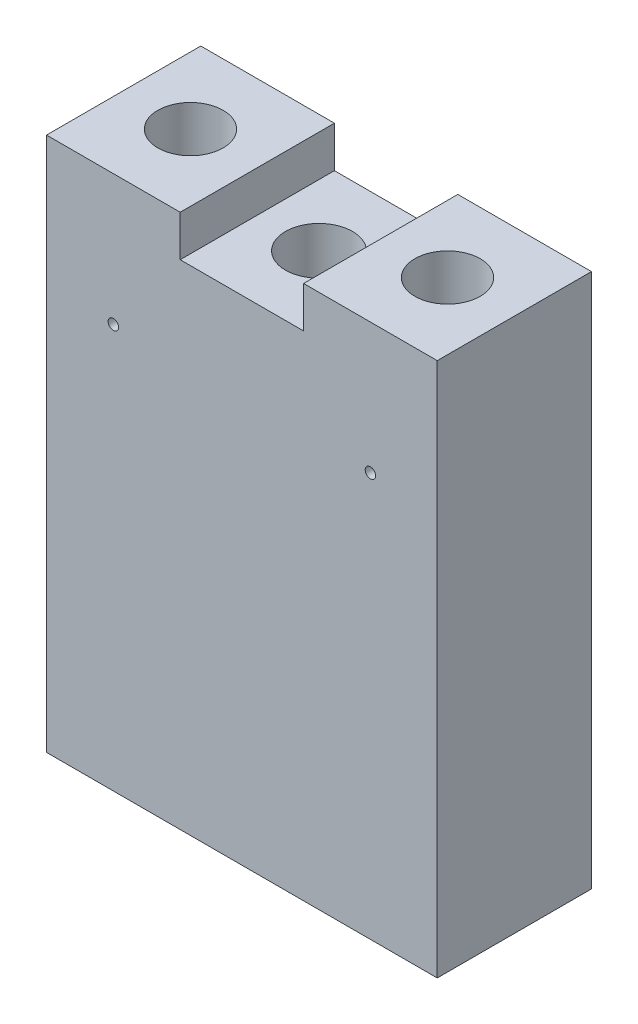
ISO-10303-21;
HEADER;
FILE_DESCRIPTION(('STEP AP214'),'2;1');
FILE_NAME('part.step','',(''),(''),'','','');
FILE_SCHEMA(('AUTOMOTIVE_DESIGN { 1 0 10303 214 1 1 1 1 }'));
ENDSEC;
DATA;
#1=APPLICATION_CONTEXT('core data for automotive mechanical design processes');
#2=APPLICATION_PROTOCOL_DEFINITION('international standard','automotive_design',2000,#1);
#3=PRODUCT_CONTEXT('',#1,'mechanical');
#4=PRODUCT('Part','Part','',(#3));
#5=PRODUCT_RELATED_PRODUCT_CATEGORY('part','',(#4));
#6=PRODUCT_DEFINITION_FORMATION('','',#4);
#7=PRODUCT_DEFINITION_CONTEXT('part definition',#1,'design');
#8=PRODUCT_DEFINITION('design','',#6,#7);
#9=PRODUCT_DEFINITION_SHAPE('','',#8);
#10=(LENGTH_UNIT() NAMED_UNIT(*) SI_UNIT(.MILLI.,.METRE.));
#11=(NAMED_UNIT(*) PLANE_ANGLE_UNIT() SI_UNIT($,.RADIAN.));
#12=(NAMED_UNIT(*) SI_UNIT($,.STERADIAN.) SOLID_ANGLE_UNIT());
#13=UNCERTAINTY_MEASURE_WITH_UNIT(LENGTH_MEASURE(1.E-05),#10,'distance_accuracy_value','');
#14=(GEOMETRIC_REPRESENTATION_CONTEXT(3) GLOBAL_UNCERTAINTY_ASSIGNED_CONTEXT((#13)) GLOBAL_UNIT_ASSIGNED_CONTEXT((#10,
#11,#12)) REPRESENTATION_CONTEXT('',''));
#15=CARTESIAN_POINT('',(0.,0.,0.));
#16=DIRECTION('',(0.,0.,1.));
#17=DIRECTION('',(1.,0.,0.));
#18=AXIS2_PLACEMENT_3D('',#15,#16,#17);
#19=CARTESIAN_POINT('',(-19.,52.0000000000001,15.));
#20=DIRECTION('',(0.,-1.,0.));
#21=DIRECTION('',(0.,0.,-1.));
#22=AXIS2_PLACEMENT_3D('',#19,#20,#21);
#23=PLANE('',#22);
#24=CARTESIAN_POINT('',(-12.5,52.0000000000001,7.5));
#25=DIRECTION('',(0.,1.,0.));
#26=DIRECTION('',(0.,0.,1.));
#27=AXIS2_PLACEMENT_3D('',#24,#25,#26);
#28=CIRCLE('',#27,3.175);
#29=CARTESIAN_POINT('',(-12.5,52.0000000000001,10.675));
#30=VERTEX_POINT('',#29);
#31=EDGE_CURVE('E163',#30,#30,#28,.T.);
#32=ORIENTED_EDGE('',*,*,#31,.F.);
#33=EDGE_LOOP('',(#32));
#34=FACE_BOUND('',#33,.T.);
#35=DIRECTION('',(-1.,0.,0.));
#36=VECTOR('',#35,1.);
#37=CARTESIAN_POINT('',(-19.,52.0000000000001,15.));
#38=LINE('',#37,#36);
#39=CARTESIAN_POINT('',(-6.00000000000002,52.0000000000001,15.));
#40=VERTEX_POINT('',#39);
#41=CARTESIAN_POINT('',(-19.,52.0000000000001,15.));
#42=VERTEX_POINT('',#41);
#43=EDGE_CURVE('E56',#40,#42,#38,.T.);
#44=ORIENTED_EDGE('',*,*,#43,.F.);
#45=DIRECTION('',(0.,0.,1.));
#46=VECTOR('',#45,1.);
#47=CARTESIAN_POINT('',(-6.00000000000002,52.0000000000001,0.));
#48=LINE('',#47,#46);
#49=CARTESIAN_POINT('',(-6.00000000000002,52.0000000000001,0.));
#50=VERTEX_POINT('',#49);
#51=EDGE_CURVE('E100',#50,#40,#48,.T.);
#52=ORIENTED_EDGE('',*,*,#51,.F.);
#53=DIRECTION('',(-1.,0.,0.));
#54=VECTOR('',#53,1.);
#55=CARTESIAN_POINT('',(-19.,52.0000000000001,0.));
#56=LINE('',#55,#54);
#57=CARTESIAN_POINT('',(-19.,52.0000000000001,0.));
#58=VERTEX_POINT('',#57);
#59=EDGE_CURVE('E149',#50,#58,#56,.T.);
#60=ORIENTED_EDGE('',*,*,#59,.T.);
#61=DIRECTION('',(0.,0.,-1.));
#62=VECTOR('',#61,1.);
#63=CARTESIAN_POINT('',(-19.,52.0000000000001,15.));
#64=LINE('',#63,#62);
#65=EDGE_CURVE('E119',#42,#58,#64,.T.);
#66=ORIENTED_EDGE('',*,*,#65,.F.);
#67=EDGE_LOOP('',(#44,#52,#60,#66));
#68=FACE_BOUND('',#67,.T.);
#69=ADVANCED_FACE('F33',(#34,#68),#23,.F.);
#70=CARTESIAN_POINT('',(-19.,52.0000000000001,15.));
#71=DIRECTION('',(1.,0.,0.));
#72=DIRECTION('',(0.,1.,0.));
#73=AXIS2_PLACEMENT_3D('',#70,#71,#72);
#74=PLANE('',#73);
#75=DIRECTION('',(0.,-1.,0.));
#76=VECTOR('',#75,1.);
#77=CARTESIAN_POINT('',(-19.,52.0000000000001,0.));
#78=LINE('',#77,#76);
#79=CARTESIAN_POINT('',(-19.,0.,0.));
#80=VERTEX_POINT('',#79);
#81=EDGE_CURVE('E152',#58,#80,#78,.T.);
#82=ORIENTED_EDGE('',*,*,#81,.T.);
#83=DIRECTION('',(0.,0.,-1.));
#84=VECTOR('',#83,1.);
#85=CARTESIAN_POINT('',(-19.,0.,15.));
#86=LINE('',#85,#84);
#87=CARTESIAN_POINT('',(-19.,0.,15.));
#88=VERTEX_POINT('',#87);
#89=EDGE_CURVE('E11',#88,#80,#86,.T.);
#90=ORIENTED_EDGE('',*,*,#89,.F.);
#91=DIRECTION('',(0.,-1.,0.));
#92=VECTOR('',#91,1.);
#93=CARTESIAN_POINT('',(-19.,52.0000000000001,15.));
#94=LINE('',#93,#92);
#95=EDGE_CURVE('E156',#42,#88,#94,.T.);
#96=ORIENTED_EDGE('',*,*,#95,.F.);
#97=ORIENTED_EDGE('',*,*,#65,.T.);
#98=EDGE_LOOP('',(#82,#90,#96,#97));
#99=FACE_BOUND('',#98,.T.);
#100=ADVANCED_FACE('F35',(#99),#74,.F.);
#101=CARTESIAN_POINT('',(-19.,0.,15.));
#102=DIRECTION('',(0.,1.,0.));
#103=DIRECTION('',(0.,0.,1.));
#104=AXIS2_PLACEMENT_3D('',#101,#102,#103);
#105=PLANE('',#104);
#106=CARTESIAN_POINT('',(0.,0.,7.5));
#107=DIRECTION('',(0.,1.,0.));
#108=DIRECTION('',(0.,0.,1.));
#109=AXIS2_PLACEMENT_3D('',#106,#107,#108);
#110=CIRCLE('',#109,3.26389999999999);
#111=CARTESIAN_POINT('',(0.,0.,10.7639));
#112=VERTEX_POINT('',#111);
#113=EDGE_CURVE('E186',#112,#112,#110,.T.);
#114=ORIENTED_EDGE('',*,*,#113,.T.);
#115=EDGE_LOOP('',(#114));
#116=FACE_BOUND('',#115,.T.);
#117=DIRECTION('',(1.,0.,0.));
#118=VECTOR('',#117,1.);
#119=CARTESIAN_POINT('',(-19.,0.,0.));
#120=LINE('',#119,#118);
#121=CARTESIAN_POINT('',(19.,0.,0.));
#122=VERTEX_POINT('',#121);
#123=EDGE_CURVE('E145',#80,#122,#120,.T.);
#124=ORIENTED_EDGE('',*,*,#123,.T.);
#125=DIRECTION('',(0.,0.,-1.));
#126=VECTOR('',#125,1.);
#127=CARTESIAN_POINT('',(19.,0.,15.));
#128=LINE('',#127,#126);
#129=CARTESIAN_POINT('',(19.,0.,15.));
#130=VERTEX_POINT('',#129);
#131=EDGE_CURVE('E41',#130,#122,#128,.T.);
#132=ORIENTED_EDGE('',*,*,#131,.F.);
#133=DIRECTION('',(1.,0.,0.));
#134=VECTOR('',#133,1.);
#135=CARTESIAN_POINT('',(-19.,0.,15.));
#136=LINE('',#135,#134);
#137=EDGE_CURVE('E125',#88,#130,#136,.T.);
#138=ORIENTED_EDGE('',*,*,#137,.F.);
#139=ORIENTED_EDGE('',*,*,#89,.T.);
#140=EDGE_LOOP('',(#124,#132,#138,#139));
#141=FACE_BOUND('',#140,.T.);
#142=ADVANCED_FACE('F158',(#116,#141),#105,.F.);
#143=CARTESIAN_POINT('',(19.,52.0000000000001,15.));
#144=DIRECTION('',(-1.,0.,0.));
#145=DIRECTION('',(0.,-1.,0.));
#146=AXIS2_PLACEMENT_3D('',#143,#144,#145);
#147=PLANE('',#146);
#148=DIRECTION('',(0.,1.,0.));
#149=VECTOR('',#148,1.);
#150=CARTESIAN_POINT('',(19.,52.0000000000001,0.));
#151=LINE('',#150,#149);
#152=CARTESIAN_POINT('',(19.,52.0000000000001,0.));
#153=VERTEX_POINT('',#152);
#154=EDGE_CURVE('E139',#122,#153,#151,.T.);
#155=ORIENTED_EDGE('',*,*,#154,.T.);
#156=DIRECTION('',(0.,0.,-1.));
#157=VECTOR('',#156,1.);
#158=CARTESIAN_POINT('',(19.,52.0000000000001,15.));
#159=LINE('',#158,#157);
#160=CARTESIAN_POINT('',(19.,52.0000000000001,15.));
#161=VERTEX_POINT('',#160);
#162=EDGE_CURVE('E130',#161,#153,#159,.T.);
#163=ORIENTED_EDGE('',*,*,#162,.F.);
#164=DIRECTION('',(0.,1.,0.));
#165=VECTOR('',#164,1.);
#166=CARTESIAN_POINT('',(19.,52.0000000000001,15.));
#167=LINE('',#166,#165);
#168=EDGE_CURVE('E122',#130,#161,#167,.T.);
#169=ORIENTED_EDGE('',*,*,#168,.F.);
#170=ORIENTED_EDGE('',*,*,#131,.T.);
#171=EDGE_LOOP('',(#155,#163,#169,#170));
#172=FACE_BOUND('',#171,.T.);
#173=ADVANCED_FACE('F137',(#172),#147,.F.);
#174=CARTESIAN_POINT('',(12.5,52.0000000000001,7.5));
#175=DIRECTION('',(0.,1.,0.));
#176=DIRECTION('',(0.,0.,-1.));
#177=AXIS2_PLACEMENT_3D('',#174,#175,#176);
#178=CIRCLE('',#177,3.175);
#179=CARTESIAN_POINT('',(12.5,52.0000000000001,4.325));
#180=VERTEX_POINT('',#179);
#181=EDGE_CURVE('E171',#180,#180,#178,.T.);
#182=ORIENTED_EDGE('',*,*,#181,.F.);
#183=EDGE_LOOP('',(#182));
#184=FACE_BOUND('',#183,.T.);
#185=CARTESIAN_POINT('',(5.99999999999998,52.0000000000001,0.));
#186=VERTEX_POINT('',#185);
#187=EDGE_CURVE('E148',#153,#186,#56,.T.);
#188=ORIENTED_EDGE('',*,*,#187,.T.);
#189=DIRECTION('',(0.,0.,-1.));
#190=VECTOR('',#189,1.);
#191=CARTESIAN_POINT('',(5.99999999999998,52.0000000000001,0.));
#192=LINE('',#191,#190);
#193=CARTESIAN_POINT('',(5.99999999999998,52.0000000000001,15.));
#194=VERTEX_POINT('',#193);
#195=EDGE_CURVE('E108',#194,#186,#192,.T.);
#196=ORIENTED_EDGE('',*,*,#195,.F.);
#197=EDGE_CURVE('E121',#161,#194,#38,.T.);
#198=ORIENTED_EDGE('',*,*,#197,.F.);
#199=ORIENTED_EDGE('',*,*,#162,.T.);
#200=EDGE_LOOP('',(#188,#196,#198,#199));
#201=FACE_BOUND('',#200,.T.);
#202=ADVANCED_FACE('F223',(#184,#201),#23,.F.);
#203=CARTESIAN_POINT('',(-19.,0.,15.));
#204=DIRECTION('',(0.,0.,1.));
#205=DIRECTION('',(1.,0.,0.));
#206=AXIS2_PLACEMENT_3D('',#203,#204,#205);
#207=PLANE('',#206);
#208=CARTESIAN_POINT('',(12.5,39.3,15.));
#209=DIRECTION('',(0.,0.,1.));
#210=DIRECTION('',(1.,0.,0.));
#211=AXIS2_PLACEMENT_3D('',#208,#209,#210);
#212=CIRCLE('',#211,0.507999999999999);
#213=CARTESIAN_POINT('',(13.008,39.3,15.));
#214=VERTEX_POINT('',#213);
#215=EDGE_CURVE('E199',#214,#214,#212,.T.);
#216=ORIENTED_EDGE('',*,*,#215,.F.);
#217=EDGE_LOOP('',(#216));
#218=FACE_BOUND('',#217,.T.);
#219=CARTESIAN_POINT('',(-12.5,39.3,15.));
#220=DIRECTION('',(0.,0.,1.));
#221=DIRECTION('',(1.,0.,0.));
#222=AXIS2_PLACEMENT_3D('',#219,#220,#221);
#223=CIRCLE('',#222,0.507999999999999);
#224=CARTESIAN_POINT('',(-11.992,39.3,15.));
#225=VERTEX_POINT('',#224);
#226=EDGE_CURVE('E189',#225,#225,#223,.T.);
#227=ORIENTED_EDGE('',*,*,#226,.F.);
#228=EDGE_LOOP('',(#227));
#229=FACE_BOUND('',#228,.T.);
#230=DIRECTION('',(0.,1.,0.));
#231=VECTOR('',#230,1.);
#232=CARTESIAN_POINT('',(-6.00000000000002,48.0000000000001,15.));
#233=LINE('',#232,#231);
#234=CARTESIAN_POINT('',(-6.00000000000002,48.0000000000001,15.));
#235=VERTEX_POINT('',#234);
#236=EDGE_CURVE('E102',#235,#40,#233,.T.);
#237=ORIENTED_EDGE('',*,*,#236,.T.);
#238=ORIENTED_EDGE('',*,*,#43,.T.);
#239=ORIENTED_EDGE('',*,*,#95,.T.);
#240=ORIENTED_EDGE('',*,*,#137,.T.);
#241=ORIENTED_EDGE('',*,*,#168,.T.);
#242=ORIENTED_EDGE('',*,*,#197,.T.);
#243=DIRECTION('',(0.,1.,0.));
#244=VECTOR('',#243,1.);
#245=CARTESIAN_POINT('',(5.99999999999998,48.0000000000001,15.));
#246=LINE('',#245,#244);
#247=CARTESIAN_POINT('',(5.99999999999998,48.0000000000001,15.));
#248=VERTEX_POINT('',#247);
#249=EDGE_CURVE('E115',#248,#194,#246,.T.);
#250=ORIENTED_EDGE('',*,*,#249,.F.);
#251=DIRECTION('',(1.,0.,0.));
#252=VECTOR('',#251,1.);
#253=CARTESIAN_POINT('',(-6.00000000000002,48.0000000000001,15.));
#254=LINE('',#253,#252);
#255=EDGE_CURVE('E114',#235,#248,#254,.T.);
#256=ORIENTED_EDGE('',*,*,#255,.F.);
#257=EDGE_LOOP('',(#237,#238,#239,#240,#241,#242,#250,#256));
#258=FACE_BOUND('',#257,.T.);
#259=ADVANCED_FACE('F112',(#218,#229,#258),#207,.T.);
#260=CARTESIAN_POINT('',(-19.,0.,0.));
#261=DIRECTION('',(0.,0.,1.));
#262=DIRECTION('',(1.,0.,0.));
#263=AXIS2_PLACEMENT_3D('',#260,#261,#262);
#264=PLANE('',#263);
#265=ORIENTED_EDGE('',*,*,#59,.F.);
#266=DIRECTION('',(0.,1.,0.));
#267=VECTOR('',#266,1.);
#268=CARTESIAN_POINT('',(-6.00000000000002,48.0000000000001,0.));
#269=LINE('',#268,#267);
#270=CARTESIAN_POINT('',(-6.00000000000002,48.0000000000001,0.));
#271=VERTEX_POINT('',#270);
#272=EDGE_CURVE('E105',#271,#50,#269,.T.);
#273=ORIENTED_EDGE('',*,*,#272,.F.);
#274=DIRECTION('',(-1.,0.,0.));
#275=VECTOR('',#274,1.);
#276=CARTESIAN_POINT('',(-6.00000000000002,48.0000000000001,0.));
#277=LINE('',#276,#275);
#278=CARTESIAN_POINT('',(5.99999999999998,48.0000000000001,0.));
#279=VERTEX_POINT('',#278);
#280=EDGE_CURVE('E116',#279,#271,#277,.T.);
#281=ORIENTED_EDGE('',*,*,#280,.F.);
#282=DIRECTION('',(0.,1.,0.));
#283=VECTOR('',#282,1.);
#284=CARTESIAN_POINT('',(5.99999999999998,48.0000000000001,0.));
#285=LINE('',#284,#283);
#286=EDGE_CURVE('E175',#279,#186,#285,.T.);
#287=ORIENTED_EDGE('',*,*,#286,.T.);
#288=ORIENTED_EDGE('',*,*,#187,.F.);
#289=ORIENTED_EDGE('',*,*,#154,.F.);
#290=ORIENTED_EDGE('',*,*,#123,.F.);
#291=ORIENTED_EDGE('',*,*,#81,.F.);
#292=EDGE_LOOP('',(#265,#273,#281,#287,#288,#289,#290,#291));
#293=FACE_BOUND('',#292,.T.);
#294=ADVANCED_FACE('F143',(#293),#264,.F.);
#295=CARTESIAN_POINT('',(-12.5,34.,7.5));
#296=DIRECTION('',(0.,1.,0.));
#297=DIRECTION('',(0.,0.,1.));
#298=AXIS2_PLACEMENT_3D('',#295,#296,#297);
#299=CYLINDRICAL_SURFACE('',#298,3.175);
#300=CARTESIAN_POINT('',(-11.992,39.3,10.6340965205303));
#301=CARTESIAN_POINT('',(-11.9920011524784,39.2716620542991,10.634097017757));
#302=CARTESIAN_POINT('',(-11.9943792039766,39.2433082310262,10.6344850234579));
#303=CARTESIAN_POINT('',(-12.0038251084261,39.1873949807826,10.6359938583127));
#304=CARTESIAN_POINT('',(-12.010897389129,39.1598363294775,10.6371153793278));
#305=CARTESIAN_POINT('',(-12.0295133287403,39.1063307624695,10.639961042904));
#306=CARTESIAN_POINT('',(-12.0410533768084,39.0803825648014,10.6416846987114));
#307=CARTESIAN_POINT('',(-12.0682684742128,39.0307939139822,10.6455398427896));
#308=CARTESIAN_POINT('',(-12.0839430155166,39.0071531777865,10.6476712809447));
#309=CARTESIAN_POINT('',(-12.1191342637994,38.9626323910698,10.652123492176));
#310=CARTESIAN_POINT('',(-12.1386811932828,38.9417763665605,10.6544456646009));
#311=CARTESIAN_POINT('',(-12.1809970570693,38.9036255172464,10.6590052394101));
#312=CARTESIAN_POINT('',(-12.2037661764232,38.8863308971137,10.6612426369163));
#313=CARTESIAN_POINT('',(-12.2520350610746,38.8557042258319,10.6653953102445));
#314=CARTESIAN_POINT('',(-12.2775491255037,38.8423944406542,10.6673087510006));
#315=CARTESIAN_POINT('',(-12.3304864970437,38.8202582774788,10.6705823751615));
#316=CARTESIAN_POINT('',(-12.3579096895222,38.8114316305574,10.6719425917508));
#317=CARTESIAN_POINT('',(-12.4136389512477,38.798585522932,10.6739466319443));
#318=CARTESIAN_POINT('',(-12.4419355077067,38.7945257456712,10.674596460487));
#319=CARTESIAN_POINT('',(-12.4988151388894,38.7912033269463,10.6751271172886));
#320=CARTESIAN_POINT('',(-12.5273981954862,38.7919403838772,10.6750079938959));
#321=CARTESIAN_POINT('',(-12.5837640478586,38.7981591153641,10.6740189406134));
#322=CARTESIAN_POINT('',(-12.6115517675797,38.8035974073989,10.6731558759476));
#323=CARTESIAN_POINT('',(-12.6658150970579,38.8189960127147,10.6707835643784));
#324=CARTESIAN_POINT('',(-12.692290669324,38.8289564551216,10.6692742990233));
#325=CARTESIAN_POINT('',(-12.7433081205479,38.8531602685099,10.6657674302876));
#326=CARTESIAN_POINT('',(-12.7678412965475,38.8674216747586,10.6637677772896));
#327=CARTESIAN_POINT('',(-12.8141826765789,38.8998093928688,10.6595025866196));
#328=CARTESIAN_POINT('',(-12.8359906767939,38.9179359935354,10.6572370290851));
#329=CARTESIAN_POINT('',(-12.8765187327968,38.9577806091444,10.6526623688348));
#330=CARTESIAN_POINT('',(-12.8952015230869,38.9795365250636,10.6503530624941));
#331=CARTESIAN_POINT('',(-12.9286572093017,39.0258940600931,10.6459757718085));
#332=CARTESIAN_POINT('',(-12.9434300744194,39.0504957016232,10.6439077893652));
#333=CARTESIAN_POINT('',(-12.9686529403333,39.1018877495291,10.6402472513662));
#334=CARTESIAN_POINT('',(-12.9790987253717,39.1286802601298,10.6386551598767));
#335=CARTESIAN_POINT('',(-12.9953313791904,39.1836706978975,10.6361345555541));
#336=CARTESIAN_POINT('',(-13.0011186241756,39.2118685113826,10.6352059891381));
#337=CARTESIAN_POINT('',(-13.007818008994,39.2685364669591,10.6341278564899));
#338=CARTESIAN_POINT('',(-13.0087831489923,39.2970001875299,10.6339698217466));
#339=CARTESIAN_POINT('',(-13.0059519155726,39.3536826374315,10.6344281195756));
#340=CARTESIAN_POINT('',(-13.0021557110715,39.3819013754178,10.6350444246769));
#341=CARTESIAN_POINT('',(-12.9899546403704,39.4371261939829,10.6369741545375));
#342=CARTESIAN_POINT('',(-12.9815765154944,39.464138336488,10.6382835329225));
#343=CARTESIAN_POINT('',(-12.9604773795549,39.5163750783023,10.6414485043351));
#344=CARTESIAN_POINT('',(-12.9477561271657,39.5415995781872,10.643304127714));
#345=CARTESIAN_POINT('',(-12.9182058316522,39.5897815878427,10.6473722975796));
#346=CARTESIAN_POINT('',(-12.9013426824384,39.6127179302068,10.6495877529553));
#347=CARTESIAN_POINT('',(-12.8640343347892,39.6554542194018,10.6541173497449));
#348=CARTESIAN_POINT('',(-12.8435889048742,39.6752539633946,10.6564314975288));
#349=CARTESIAN_POINT('',(-12.7994621277398,39.7113472321916,10.6609243888847));
#350=CARTESIAN_POINT('',(-12.7757517681024,39.7276055021942,10.6631016299261));
#351=CARTESIAN_POINT('',(-12.7259055292367,39.7559079136811,10.6670516033167));
#352=CARTESIAN_POINT('',(-12.699769723644,39.767952183048,10.6688243479405));
#353=CARTESIAN_POINT('',(-12.645921419382,39.7874292319008,10.6717590361935));
#354=CARTESIAN_POINT('',(-12.6182158578271,39.794880799984,10.6729234653995));
#355=CARTESIAN_POINT('',(-12.5619265348258,39.8050215544437,10.6745208012722));
#356=CARTESIAN_POINT('',(-12.5333428399075,39.8077111006932,10.6749537632168));
#357=CARTESIAN_POINT('',(-12.4764495871706,39.8082417567122,10.675038693973));
#358=CARTESIAN_POINT('',(-12.4481405292251,39.8061366304484,10.6746993231958));
#359=CARTESIAN_POINT('',(-12.3922846118912,39.797253555079,10.6732953101071));
#360=CARTESIAN_POINT('',(-12.3647377490264,39.790475627289,10.672230671104));
#361=CARTESIAN_POINT('',(-12.3112063407293,39.7724593484938,10.6694952585193));
#362=CARTESIAN_POINT('',(-12.2852203426095,39.7612252212998,10.6678250590472));
#363=CARTESIAN_POINT('',(-12.2354937476305,39.7346213150639,10.6640613120954));
#364=CARTESIAN_POINT('',(-12.2117532436331,39.7192513650869,10.6619677471189));
#365=CARTESIAN_POINT('',(-12.1669199215669,39.6846199266221,10.6575617478417));
#366=CARTESIAN_POINT('',(-12.1458578245696,39.6653189282404,10.6552472294172));
#367=CARTESIAN_POINT('',(-12.1072521975303,39.6234563333097,10.6506750156967));
#368=CARTESIAN_POINT('',(-12.0897094930571,39.6008939738508,10.6484173338416));
#369=CARTESIAN_POINT('',(-12.0585373529886,39.5529765898212,10.6441987028334));
#370=CARTESIAN_POINT('',(-12.0449339400804,39.5276044596212,10.6422397656472));
#371=CARTESIAN_POINT('',(-12.0222026767232,39.4749149944117,10.6388641112512));
#372=CARTESIAN_POINT('',(-12.0130702833795,39.4475996663049,10.6374468439863));
#373=CARTESIAN_POINT('',(-12.0015605964176,39.4001425586394,10.63563474992));
#374=CARTESIAN_POINT('',(-11.9979810139114,39.3802905954591,10.6350610593484));
#375=CARTESIAN_POINT('',(-11.9932003248269,39.3402950947809,10.6342917708646));
#376=CARTESIAN_POINT('',(-11.9919991804544,39.3201515619213,10.6340961669445));
#377=CARTESIAN_POINT('',(-11.992,39.3,10.6340965205303));
#378=B_SPLINE_CURVE_WITH_KNOTS('',3,(#300,#301,#302,#303,#304,#305,#306,#307,#308,#309,#310,
#311,#312,#313,#314,#315,#316,#317,#318,#319,#320,#321,#322,#323,#324,#325,#326,#327,#328,#329,
#330,#331,#332,#333,#334,#335,#336,#337,#338,#339,#340,#341,#342,#343,#344,#345,#346,#347,#348,
#349,#350,#351,#352,#353,#354,#355,#356,#357,#358,#359,#360,#361,#362,#363,#364,#365,#366,#367,
#368,#369,#370,#371,#372,#373,#374,#375,#376,#377),.UNSPECIFIED.,.T.,.F.,(4,2,2,2,2,2,2,2,2,2,2,
2,2,2,2,2,2,2,2,2,2,2,2,2,2,2,2,2,2,2,2,2,2,2,2,2,2,2,4),(0.,0.0849401609411802,
0.169960554312599,0.254912377340203,0.33985376663286,0.42548624410483,0.511123641456085,
0.597230986130252,0.683333164991699,0.768701752178547,0.854064971795071,0.93864877635798,
1.0232349962868,1.10818096416417,1.19313328138275,1.27903575620985,1.36493890785955,
1.45092555691149,1.5369052613317,1.62193784407911,1.70696741023213,1.79150593617779,
1.87604916026629,1.96131336953361,2.04658309043021,2.13266636051691,2.21874701800293,
2.30447314330288,2.39019278987926,2.47495597729303,2.55971877805099,2.64440142758682,
2.72908757762479,2.81467108149413,2.9002746378773,2.98643141830932,3.07250047429479,
3.13290372760424,3.1933060210827),.UNSPECIFIED.);
#379=CARTESIAN_POINT('',(-11.992,39.3,10.6340965205303));
#380=VERTEX_POINT('',#379);
#381=EDGE_CURVE('E192',#380,#380,#378,.T.);
#382=ORIENTED_EDGE('',*,*,#381,.F.);
#383=EDGE_LOOP('',(#382));
#384=FACE_BOUND('',#383,.T.);
#385=CARTESIAN_POINT('',(-12.5,34.,7.5));
#386=DIRECTION('',(0.,1.,0.));
#387=DIRECTION('',(0.,0.,1.));
#388=AXIS2_PLACEMENT_3D('',#385,#386,#387);
#389=CIRCLE('',#388,3.175);
#390=CARTESIAN_POINT('',(-12.5,34.,10.675));
#391=VERTEX_POINT('',#390);
#392=EDGE_CURVE('E161',#391,#391,#389,.T.);
#393=ORIENTED_EDGE('',*,*,#392,.F.);
#394=EDGE_LOOP('',(#393));
#395=FACE_BOUND('',#394,.T.);
#396=ORIENTED_EDGE('',*,*,#31,.T.);
#397=EDGE_LOOP('',(#396));
#398=FACE_BOUND('',#397,.T.);
#399=ADVANCED_FACE('F232',(#384,#395,#398),#299,.F.);
#400=CARTESIAN_POINT('',(-12.5,34.,7.5));
#401=DIRECTION('',(0.,1.,0.));
#402=DIRECTION('',(0.,0.,1.));
#403=AXIS2_PLACEMENT_3D('',#400,#401,#402);
#404=PLANE('',#403);
#405=ORIENTED_EDGE('',*,*,#392,.T.);
#406=EDGE_LOOP('',(#405));
#407=FACE_BOUND('',#406,.T.);
#408=ADVANCED_FACE('F235',(#407),#404,.T.);
#409=CARTESIAN_POINT('',(12.5,34.,7.5));
#410=DIRECTION('',(0.,1.,0.));
#411=DIRECTION('',(0.,0.,1.));
#412=AXIS2_PLACEMENT_3D('',#409,#410,#411);
#413=CYLINDRICAL_SURFACE('',#412,3.175);
#414=CARTESIAN_POINT('',(13.008,39.3,10.6340965205303));
#415=CARTESIAN_POINT('',(13.0079988475216,39.2716620542991,10.634097017757));
#416=CARTESIAN_POINT('',(13.0056207960234,39.2433082310262,10.6344850234579));
#417=CARTESIAN_POINT('',(12.9961748915739,39.1873949807826,10.6359938583127));
#418=CARTESIAN_POINT('',(12.989102610871,39.1598363294775,10.6371153793278));
#419=CARTESIAN_POINT('',(12.9704866712597,39.1063307624695,10.639961042904));
#420=CARTESIAN_POINT('',(12.9589466231916,39.0803825648014,10.6416846987114));
#421=CARTESIAN_POINT('',(12.9317315257872,39.0307939139822,10.6455398427896));
#422=CARTESIAN_POINT('',(12.9160569844834,39.0071531777865,10.6476712809447));
#423=CARTESIAN_POINT('',(12.8808657362006,38.9626323910698,10.652123492176));
#424=CARTESIAN_POINT('',(12.8613188067172,38.9417763665605,10.6544456646009));
#425=CARTESIAN_POINT('',(12.8190029429307,38.9036255172464,10.6590052394101));
#426=CARTESIAN_POINT('',(12.7962338235768,38.8863308971137,10.6612426369163));
#427=CARTESIAN_POINT('',(12.7479649389254,38.8557042258319,10.6653953102445));
#428=CARTESIAN_POINT('',(12.7224508744963,38.8423944406542,10.6673087510006));
#429=CARTESIAN_POINT('',(12.6695135029563,38.8202582774788,10.6705823751615));
#430=CARTESIAN_POINT('',(12.6420903104778,38.8114316305574,10.6719425917508));
#431=CARTESIAN_POINT('',(12.5863610487523,38.798585522932,10.6739466319443));
#432=CARTESIAN_POINT('',(12.5580644922933,38.7945257456712,10.674596460487));
#433=CARTESIAN_POINT('',(12.5011848611106,38.7912033269463,10.6751271172886));
#434=CARTESIAN_POINT('',(12.4726018045138,38.7919403838772,10.6750079938959));
#435=CARTESIAN_POINT('',(12.4162359521414,38.7981591153641,10.6740189406134));
#436=CARTESIAN_POINT('',(12.3884482324203,38.8035974073989,10.6731558759476));
#437=CARTESIAN_POINT('',(12.3341849029421,38.8189960127147,10.6707835643784));
#438=CARTESIAN_POINT('',(12.307709330676,38.8289564551216,10.6692742990233));
#439=CARTESIAN_POINT('',(12.2566918794521,38.8531602685099,10.6657674302876));
#440=CARTESIAN_POINT('',(12.2321587034525,38.8674216747586,10.6637677772896));
#441=CARTESIAN_POINT('',(12.1858173234211,38.8998093928688,10.6595025866196));
#442=CARTESIAN_POINT('',(12.1640093232061,38.9179359935354,10.6572370290851));
#443=CARTESIAN_POINT('',(12.1234812672032,38.9577806091444,10.6526623688348));
#444=CARTESIAN_POINT('',(12.1047984769131,38.9795365250636,10.6503530624941));
#445=CARTESIAN_POINT('',(12.0713427906983,39.0258940600931,10.6459757718085));
#446=CARTESIAN_POINT('',(12.0565699255806,39.0504957016232,10.6439077893652));
#447=CARTESIAN_POINT('',(12.0313470596667,39.1018877495291,10.6402472513662));
#448=CARTESIAN_POINT('',(12.0209012746283,39.1286802601298,10.6386551598767));
#449=CARTESIAN_POINT('',(12.0046686208096,39.1836706978975,10.6361345555541));
#450=CARTESIAN_POINT('',(11.9988813758244,39.2118685113826,10.6352059891381));
#451=CARTESIAN_POINT('',(11.992181991006,39.2685364669591,10.6341278564899));
#452=CARTESIAN_POINT('',(11.9912168510077,39.2970001875299,10.6339698217466));
#453=CARTESIAN_POINT('',(11.9940480844274,39.3536826374315,10.6344281195756));
#454=CARTESIAN_POINT('',(11.9978442889285,39.3819013754178,10.6350444246769));
#455=CARTESIAN_POINT('',(12.0100453596296,39.4371261939829,10.6369741545375));
#456=CARTESIAN_POINT('',(12.0184234845056,39.464138336488,10.6382835329225));
#457=CARTESIAN_POINT('',(12.0395226204451,39.5163750783023,10.6414485043351));
#458=CARTESIAN_POINT('',(12.0522438728343,39.5415995781872,10.643304127714));
#459=CARTESIAN_POINT('',(12.0817941683478,39.5897815878427,10.6473722975796));
#460=CARTESIAN_POINT('',(12.0986573175616,39.6127179302068,10.6495877529553));
#461=CARTESIAN_POINT('',(12.1359656652108,39.6554542194018,10.6541173497449));
#462=CARTESIAN_POINT('',(12.1564110951258,39.6752539633946,10.6564314975288));
#463=CARTESIAN_POINT('',(12.2005378722602,39.7113472321916,10.6609243888847));
#464=CARTESIAN_POINT('',(12.2242482318976,39.7276055021942,10.6631016299261));
#465=CARTESIAN_POINT('',(12.2740944707633,39.7559079136811,10.6670516033167));
#466=CARTESIAN_POINT('',(12.300230276356,39.767952183048,10.6688243479405));
#467=CARTESIAN_POINT('',(12.354078580618,39.7874292319008,10.6717590361935));
#468=CARTESIAN_POINT('',(12.381784142173,39.794880799984,10.6729234653995));
#469=CARTESIAN_POINT('',(12.4380734651742,39.8050215544437,10.6745208012722));
#470=CARTESIAN_POINT('',(12.4666571600925,39.8077111006932,10.6749537632168));
#471=CARTESIAN_POINT('',(12.5235504128294,39.8082417567122,10.675038693973));
#472=CARTESIAN_POINT('',(12.5518594707749,39.8061366304484,10.6746993231958));
#473=CARTESIAN_POINT('',(12.6077153881088,39.797253555079,10.6732953101071));
#474=CARTESIAN_POINT('',(12.6352622509736,39.790475627289,10.672230671104));
#475=CARTESIAN_POINT('',(12.6887936592707,39.7724593484938,10.6694952585193));
#476=CARTESIAN_POINT('',(12.7147796573905,39.7612252212998,10.6678250590472));
#477=CARTESIAN_POINT('',(12.7645062523695,39.7346213150639,10.6640613120954));
#478=CARTESIAN_POINT('',(12.7882467563669,39.7192513650869,10.6619677471189));
#479=CARTESIAN_POINT('',(12.8330800784331,39.6846199266221,10.6575617478417));
#480=CARTESIAN_POINT('',(12.8541421754304,39.6653189282404,10.6552472294172));
#481=CARTESIAN_POINT('',(12.8927478024697,39.6234563333097,10.6506750156967));
#482=CARTESIAN_POINT('',(12.9102905069429,39.6008939738508,10.6484173338416));
#483=CARTESIAN_POINT('',(12.9414626470114,39.5529765898212,10.6441987028334));
#484=CARTESIAN_POINT('',(12.9550660599196,39.5276044596212,10.6422397656472));
#485=CARTESIAN_POINT('',(12.9777973232768,39.4749149944117,10.6388641112512));
#486=CARTESIAN_POINT('',(12.9869297166205,39.4475996663049,10.6374468439863));
#487=CARTESIAN_POINT('',(12.9984394035824,39.4001425586394,10.63563474992));
#488=CARTESIAN_POINT('',(13.0020189860886,39.3802905954591,10.6350610593484));
#489=CARTESIAN_POINT('',(13.0067996751731,39.3402950947809,10.6342917708646));
#490=CARTESIAN_POINT('',(13.0080008195456,39.3201515619213,10.6340961669445));
#491=CARTESIAN_POINT('',(13.008,39.3,10.6340965205303));
#492=B_SPLINE_CURVE_WITH_KNOTS('',3,(#414,#415,#416,#417,#418,#419,#420,#421,#422,#423,#424,
#425,#426,#427,#428,#429,#430,#431,#432,#433,#434,#435,#436,#437,#438,#439,#440,#441,#442,#443,
#444,#445,#446,#447,#448,#449,#450,#451,#452,#453,#454,#455,#456,#457,#458,#459,#460,#461,#462,
#463,#464,#465,#466,#467,#468,#469,#470,#471,#472,#473,#474,#475,#476,#477,#478,#479,#480,#481,
#482,#483,#484,#485,#486,#487,#488,#489,#490,#491),.UNSPECIFIED.,.T.,.F.,(4,2,2,2,2,2,2,2,2,2,2,
2,2,2,2,2,2,2,2,2,2,2,2,2,2,2,2,2,2,2,2,2,2,2,2,2,2,2,4),(0.,0.0849401609411802,
0.169960554312599,0.254912377340203,0.33985376663286,0.425486244104829,0.511123641456085,
0.597230986130252,0.683333164991699,0.768701752178549,0.854064971795071,0.93864877635798,
1.0232349962868,1.10818096416417,1.19313328138275,1.27903575620985,1.36493890785955,
1.45092555691149,1.5369052613317,1.62193784407911,1.70696741023213,1.79150593617779,
1.87604916026629,1.96131336953361,2.04658309043021,2.13266636051691,2.21874701800293,
2.30447314330288,2.39019278987926,2.47495597729303,2.55971877805099,2.64440142758682,
2.72908757762479,2.81467108149413,2.9002746378773,2.98643141830932,3.07250047429479,
3.13290372760424,3.1933060210827),.UNSPECIFIED.);
#493=CARTESIAN_POINT('',(13.008,39.3,10.6340965205303));
#494=VERTEX_POINT('',#493);
#495=EDGE_CURVE('E212',#494,#494,#492,.T.);
#496=ORIENTED_EDGE('',*,*,#495,.F.);
#497=EDGE_LOOP('',(#496));
#498=FACE_BOUND('',#497,.T.);
#499=CARTESIAN_POINT('',(12.5,34.,7.5));
#500=DIRECTION('',(0.,1.,0.));
#501=DIRECTION('',(0.,0.,-1.));
#502=AXIS2_PLACEMENT_3D('',#499,#500,#501);
#503=CIRCLE('',#502,3.175);
#504=CARTESIAN_POINT('',(12.5,34.,4.325));
#505=VERTEX_POINT('',#504);
#506=EDGE_CURVE('E168',#505,#505,#503,.T.);
#507=ORIENTED_EDGE('',*,*,#506,.F.);
#508=EDGE_LOOP('',(#507));
#509=FACE_BOUND('',#508,.T.);
#510=ORIENTED_EDGE('',*,*,#181,.T.);
#511=EDGE_LOOP('',(#510));
#512=FACE_BOUND('',#511,.T.);
#513=ADVANCED_FACE('F276',(#498,#509,#512),#413,.F.);
#514=CARTESIAN_POINT('',(12.5,34.,7.5));
#515=DIRECTION('',(0.,-1.,0.));
#516=DIRECTION('',(0.,0.,-1.));
#517=AXIS2_PLACEMENT_3D('',#514,#515,#516);
#518=PLANE('',#517);
#519=ORIENTED_EDGE('',*,*,#506,.T.);
#520=EDGE_LOOP('',(#519));
#521=FACE_BOUND('',#520,.T.);
#522=ADVANCED_FACE('F273',(#521),#518,.F.);
#523=CARTESIAN_POINT('',(-6.00000000000002,48.0000000000001,0.));
#524=DIRECTION('',(-1.,0.,0.));
#525=DIRECTION('',(0.,0.,1.));
#526=AXIS2_PLACEMENT_3D('',#523,#524,#525);
#527=PLANE('',#526);
#528=ORIENTED_EDGE('',*,*,#51,.T.);
#529=ORIENTED_EDGE('',*,*,#236,.F.);
#530=DIRECTION('',(0.,0.,1.));
#531=VECTOR('',#530,1.);
#532=CARTESIAN_POINT('',(-6.00000000000002,48.0000000000001,0.));
#533=LINE('',#532,#531);
#534=EDGE_CURVE('E181',#271,#235,#533,.T.);
#535=ORIENTED_EDGE('',*,*,#534,.F.);
#536=ORIENTED_EDGE('',*,*,#272,.T.);
#537=EDGE_LOOP('',(#528,#529,#535,#536));
#538=FACE_BOUND('',#537,.T.);
#539=ADVANCED_FACE('F101',(#538),#527,.F.);
#540=CARTESIAN_POINT('',(5.99999999999998,48.0000000000001,0.));
#541=DIRECTION('',(1.,0.,0.));
#542=DIRECTION('',(0.,0.,-1.));
#543=AXIS2_PLACEMENT_3D('',#540,#541,#542);
#544=PLANE('',#543);
#545=ORIENTED_EDGE('',*,*,#195,.T.);
#546=ORIENTED_EDGE('',*,*,#286,.F.);
#547=DIRECTION('',(0.,0.,-1.));
#548=VECTOR('',#547,1.);
#549=CARTESIAN_POINT('',(5.99999999999998,48.0000000000001,0.));
#550=LINE('',#549,#548);
#551=EDGE_CURVE('E48',#248,#279,#550,.T.);
#552=ORIENTED_EDGE('',*,*,#551,.F.);
#553=ORIENTED_EDGE('',*,*,#249,.T.);
#554=EDGE_LOOP('',(#545,#546,#552,#553));
#555=FACE_BOUND('',#554,.T.);
#556=ADVANCED_FACE('F257',(#555),#544,.F.);
#557=CARTESIAN_POINT('',(-6.00000000000002,48.0000000000001,15.));
#558=DIRECTION('',(0.,1.,0.));
#559=DIRECTION('',(0.,0.,1.));
#560=AXIS2_PLACEMENT_3D('',#557,#558,#559);
#561=PLANE('',#560);
#562=CARTESIAN_POINT('',(0.,48.0000000000001,7.5));
#563=DIRECTION('',(0.,1.,0.));
#564=DIRECTION('',(0.,0.,1.));
#565=AXIS2_PLACEMENT_3D('',#562,#563,#564);
#566=CIRCLE('',#565,3.2639);
#567=CARTESIAN_POINT('',(0.,48.0000000000001,10.7639));
#568=VERTEX_POINT('',#567);
#569=EDGE_CURVE('E109',#568,#568,#566,.T.);
#570=ORIENTED_EDGE('',*,*,#569,.F.);
#571=EDGE_LOOP('',(#570));
#572=FACE_BOUND('',#571,.T.);
#573=ORIENTED_EDGE('',*,*,#534,.T.);
#574=ORIENTED_EDGE('',*,*,#255,.T.);
#575=ORIENTED_EDGE('',*,*,#551,.T.);
#576=ORIENTED_EDGE('',*,*,#280,.T.);
#577=EDGE_LOOP('',(#573,#574,#575,#576));
#578=FACE_BOUND('',#577,.T.);
#579=ADVANCED_FACE('F259',(#572,#578),#561,.T.);
#580=CARTESIAN_POINT('',(0.,48.0000000000001,7.5));
#581=DIRECTION('',(0.,1.,0.));
#582=DIRECTION('',(0.,0.,1.));
#583=AXIS2_PLACEMENT_3D('',#580,#581,#582);
#584=CYLINDRICAL_SURFACE('',#583,3.26389999999999);
#585=ORIENTED_EDGE('',*,*,#113,.F.);
#586=EDGE_LOOP('',(#585));
#587=FACE_BOUND('',#586,.T.);
#588=ORIENTED_EDGE('',*,*,#569,.T.);
#589=EDGE_LOOP('',(#588));
#590=FACE_BOUND('',#589,.T.);
#591=ADVANCED_FACE('F229',(#587,#590),#584,.F.);
#592=CARTESIAN_POINT('',(-12.5,39.3,-0.001000000000001));
#593=DIRECTION('',(0.,0.,1.));
#594=DIRECTION('',(1.,0.,0.));
#595=AXIS2_PLACEMENT_3D('',#592,#593,#594);
#596=CYLINDRICAL_SURFACE('',#595,0.507999999999999);
#597=ORIENTED_EDGE('',*,*,#226,.T.);
#598=EDGE_LOOP('',(#597));
#599=FACE_BOUND('',#598,.T.);
#600=ORIENTED_EDGE('',*,*,#381,.T.);
#601=EDGE_LOOP('',(#600));
#602=FACE_BOUND('',#601,.T.);
#603=ADVANCED_FACE('F201',(#599,#602),#596,.F.);
#604=CARTESIAN_POINT('',(12.5,39.3,-0.001000000000001));
#605=DIRECTION('',(0.,0.,1.));
#606=DIRECTION('',(1.,0.,0.));
#607=AXIS2_PLACEMENT_3D('',#604,#605,#606);
#608=CYLINDRICAL_SURFACE('',#607,0.507999999999999);
#609=ORIENTED_EDGE('',*,*,#215,.T.);
#610=EDGE_LOOP('',(#609));
#611=FACE_BOUND('',#610,.T.);
#612=ORIENTED_EDGE('',*,*,#495,.T.);
#613=EDGE_LOOP('',(#612));
#614=FACE_BOUND('',#613,.T.);
#615=ADVANCED_FACE('F206',(#611,#614),#608,.F.);
#616=CLOSED_SHELL('',(#69,#100,#142,#173,#202,#259,#294,#399,#408,#513,#522,#539,#556,#579,#591,
#603,#615));
#617=MANIFOLD_SOLID_BREP('B2',#616);
#618=ADVANCED_BREP_SHAPE_REPRESENTATION('',(#18,#617),#14);
#619=SHAPE_DEFINITION_REPRESENTATION(#9,#618);
ENDSEC;
END-ISO-10303-21;
